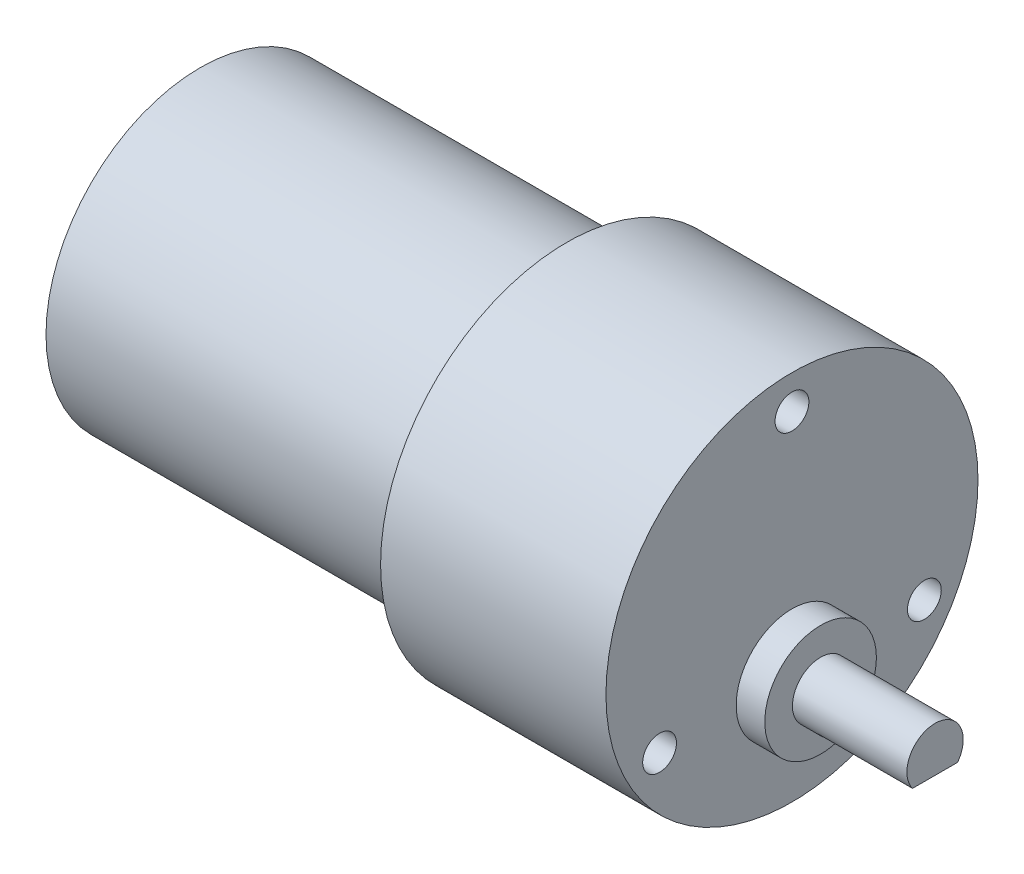
ISO-10303-21;
HEADER;
FILE_DESCRIPTION(('STEP AP214'),'2;1');
FILE_NAME('part.step','',(''),(''),'','','');
FILE_SCHEMA(('AUTOMOTIVE_DESIGN { 1 0 10303 214 1 1 1 1 }'));
ENDSEC;
DATA;
#1=APPLICATION_CONTEXT('core data for automotive mechanical design processes');
#2=APPLICATION_PROTOCOL_DEFINITION('international standard','automotive_design',2000,#1);
#3=PRODUCT_CONTEXT('',#1,'mechanical');
#4=PRODUCT('Part','Part','',(#3));
#5=PRODUCT_RELATED_PRODUCT_CATEGORY('part','',(#4));
#6=PRODUCT_DEFINITION_FORMATION('','',#4);
#7=PRODUCT_DEFINITION_CONTEXT('part definition',#1,'design');
#8=PRODUCT_DEFINITION('design','',#6,#7);
#9=PRODUCT_DEFINITION_SHAPE('','',#8);
#10=(LENGTH_UNIT() NAMED_UNIT(*) SI_UNIT(.MILLI.,.METRE.));
#11=(NAMED_UNIT(*) PLANE_ANGLE_UNIT() SI_UNIT($,.RADIAN.));
#12=(NAMED_UNIT(*) SI_UNIT($,.STERADIAN.) SOLID_ANGLE_UNIT());
#13=UNCERTAINTY_MEASURE_WITH_UNIT(LENGTH_MEASURE(1.E-05),#10,'distance_accuracy_value','');
#14=(GEOMETRIC_REPRESENTATION_CONTEXT(3) GLOBAL_UNCERTAINTY_ASSIGNED_CONTEXT((#13)) GLOBAL_UNIT_ASSIGNED_CONTEXT((#10,
#11,#12)) REPRESENTATION_CONTEXT('',''));
#15=CARTESIAN_POINT('',(0.,0.,0.));
#16=DIRECTION('',(0.,0.,1.));
#17=DIRECTION('',(1.,0.,0.));
#18=AXIS2_PLACEMENT_3D('',#15,#16,#17);
#19=CARTESIAN_POINT('',(32.7,-6.60400000000002,0.));
#20=DIRECTION('',(-1.,0.,0.));
#21=DIRECTION('',(0.,0.,1.));
#22=AXIS2_PLACEMENT_3D('',#19,#20,#21);
#23=CYLINDRICAL_SURFACE('',#22,2.5);
#24=CARTESIAN_POINT('',(22.54,-6.60400000000002,0.));
#25=DIRECTION('',(1.,0.,0.));
#26=DIRECTION('',(0.,0.,-1.));
#27=AXIS2_PLACEMENT_3D('',#24,#25,#26);
#28=CIRCLE('',#27,2.5);
#29=CARTESIAN_POINT('',(22.54,-6.60400000000002,-2.5));
#30=VERTEX_POINT('',#29);
#31=EDGE_CURVE('E74',#30,#30,#28,.T.);
#32=ORIENTED_EDGE('',*,*,#31,.T.);
#33=EDGE_LOOP('',(#32));
#34=FACE_BOUND('',#33,.T.);
#35=DIRECTION('',(1.,0.,0.));
#36=VECTOR('',#35,1.);
#37=CARTESIAN_POINT('',(24.318,-8.10400000000002,2.));
#38=LINE('',#37,#36);
#39=CARTESIAN_POINT('',(24.318,-8.10400000000002,2.));
#40=VERTEX_POINT('',#39);
#41=CARTESIAN_POINT('',(32.7,-8.10400000000002,2.));
#42=VERTEX_POINT('',#41);
#43=EDGE_CURVE('E62',#40,#42,#38,.T.);
#44=ORIENTED_EDGE('',*,*,#43,.T.);
#45=CARTESIAN_POINT('',(32.7,-6.60400000000002,0.));
#46=DIRECTION('',(1.,0.,0.));
#47=DIRECTION('',(0.,0.,-1.));
#48=AXIS2_PLACEMENT_3D('',#45,#46,#47);
#49=CIRCLE('',#48,2.5);
#50=CARTESIAN_POINT('',(32.7,-8.10400000000002,-2.));
#51=VERTEX_POINT('',#50);
#52=EDGE_CURVE('E69',#51,#42,#49,.T.);
#53=ORIENTED_EDGE('',*,*,#52,.F.);
#54=DIRECTION('',(1.,0.,0.));
#55=VECTOR('',#54,1.);
#56=CARTESIAN_POINT('',(24.318,-8.10400000000002,-2.));
#57=LINE('',#56,#55);
#58=CARTESIAN_POINT('',(24.318,-8.10400000000002,-2.));
#59=VERTEX_POINT('',#58);
#60=EDGE_CURVE('E49',#59,#51,#57,.T.);
#61=ORIENTED_EDGE('',*,*,#60,.F.);
#62=CARTESIAN_POINT('',(24.318,-6.60400000000002,0.));
#63=DIRECTION('',(1.,0.,0.));
#64=DIRECTION('',(0.,0.,-1.));
#65=AXIS2_PLACEMENT_3D('',#62,#63,#64);
#66=CIRCLE('',#65,2.5);
#67=EDGE_CURVE('E70',#40,#59,#66,.T.);
#68=ORIENTED_EDGE('',*,*,#67,.F.);
#69=EDGE_LOOP('',(#44,#53,#61,#68));
#70=FACE_BOUND('',#69,.T.);
#71=ADVANCED_FACE('F34',(#34,#70),#23,.T.);
#72=CARTESIAN_POINT('',(32.7,-6.60400000000002,0.));
#73=DIRECTION('',(1.,0.,0.));
#74=DIRECTION('',(0.,0.,-1.));
#75=AXIS2_PLACEMENT_3D('',#72,#73,#74);
#76=PLANE('',#75);
#77=ORIENTED_EDGE('',*,*,#52,.T.);
#78=DIRECTION('',(0.,0.,-1.));
#79=VECTOR('',#78,1.);
#80=CARTESIAN_POINT('',(32.7,-8.10400000000002,-5.64142135623731));
#81=LINE('',#80,#79);
#82=EDGE_CURVE('E59',#42,#51,#81,.T.);
#83=ORIENTED_EDGE('',*,*,#82,.T.);
#84=EDGE_LOOP('',(#77,#83));
#85=FACE_BOUND('',#84,.T.);
#86=ADVANCED_FACE('F72',(#85),#76,.T.);
#87=CARTESIAN_POINT('',(-34.512,0.,0.));
#88=DIRECTION('',(-1.,0.,0.));
#89=DIRECTION('',(0.,0.,1.));
#90=AXIS2_PLACEMENT_3D('',#87,#88,#89);
#91=PLANE('',#90);
#92=CARTESIAN_POINT('',(-34.512,0.,0.));
#93=DIRECTION('',(-1.,0.,0.));
#94=DIRECTION('',(0.,0.,1.));
#95=AXIS2_PLACEMENT_3D('',#92,#93,#94);
#96=CIRCLE('',#95,5.);
#97=CARTESIAN_POINT('',(-34.512,0.,5.));
#98=VERTEX_POINT('',#97);
#99=EDGE_CURVE('E80',#98,#98,#96,.T.);
#100=ORIENTED_EDGE('',*,*,#99,.T.);
#101=EDGE_LOOP('',(#100));
#102=FACE_BOUND('',#101,.T.);
#103=CARTESIAN_POINT('',(-34.512,0.,0.));
#104=DIRECTION('',(-1.,0.,0.));
#105=DIRECTION('',(0.,0.,1.));
#106=AXIS2_PLACEMENT_3D('',#103,#104,#105);
#107=CIRCLE('',#106,1.143);
#108=CARTESIAN_POINT('',(-34.512,0.,1.143));
#109=VERTEX_POINT('',#108);
#110=EDGE_CURVE('E191',#109,#109,#107,.T.);
#111=ORIENTED_EDGE('',*,*,#110,.F.);
#112=EDGE_LOOP('',(#111));
#113=FACE_BOUND('',#112,.T.);
#114=ADVANCED_FACE('F144',(#102,#113),#91,.T.);
#115=CARTESIAN_POINT('',(-32.512,0.,0.));
#116=DIRECTION('',(-1.,0.,0.));
#117=DIRECTION('',(0.,0.,1.));
#118=AXIS2_PLACEMENT_3D('',#115,#116,#117);
#119=PLANE('',#118);
#120=CARTESIAN_POINT('',(-32.512,0.,0.));
#121=DIRECTION('',(-1.,0.,0.));
#122=DIRECTION('',(0.,0.,1.));
#123=AXIS2_PLACEMENT_3D('',#120,#121,#122);
#124=CIRCLE('',#123,13.6906);
#125=CARTESIAN_POINT('',(-32.512,0.,13.6906));
#126=VERTEX_POINT('',#125);
#127=EDGE_CURVE('E104',#126,#126,#124,.T.);
#128=ORIENTED_EDGE('',*,*,#127,.T.);
#129=EDGE_LOOP('',(#128));
#130=FACE_BOUND('',#129,.T.);
#131=CARTESIAN_POINT('',(-32.512,0.,0.));
#132=DIRECTION('',(-1.,0.,0.));
#133=DIRECTION('',(0.,0.,1.));
#134=AXIS2_PLACEMENT_3D('',#131,#132,#133);
#135=CIRCLE('',#134,5.);
#136=CARTESIAN_POINT('',(-32.512,0.,5.));
#137=VERTEX_POINT('',#136);
#138=EDGE_CURVE('E83',#137,#137,#135,.T.);
#139=ORIENTED_EDGE('',*,*,#138,.F.);
#140=EDGE_LOOP('',(#139));
#141=FACE_BOUND('',#140,.T.);
#142=ADVANCED_FACE('F151',(#130,#141),#119,.T.);
#143=CARTESIAN_POINT('',(22.54,-6.60400000000002,0.));
#144=DIRECTION('',(1.,0.,0.));
#145=DIRECTION('',(0.,0.,-1.));
#146=AXIS2_PLACEMENT_3D('',#143,#144,#145);
#147=PLANE('',#146);
#148=CARTESIAN_POINT('',(22.54,-6.60400000000002,0.));
#149=DIRECTION('',(1.,0.,0.));
#150=DIRECTION('',(0.,0.,-1.));
#151=AXIS2_PLACEMENT_3D('',#148,#149,#150);
#152=CIRCLE('',#151,4.953);
#153=CARTESIAN_POINT('',(22.54,-6.60400000000002,-4.953));
#154=VERTEX_POINT('',#153);
#155=EDGE_CURVE('E77',#154,#154,#152,.T.);
#156=ORIENTED_EDGE('',*,*,#155,.T.);
#157=EDGE_LOOP('',(#156));
#158=FACE_BOUND('',#157,.T.);
#159=ORIENTED_EDGE('',*,*,#31,.F.);
#160=EDGE_LOOP('',(#159));
#161=FACE_BOUND('',#160,.T.);
#162=ADVANCED_FACE('F148',(#158,#161),#147,.T.);
#163=CARTESIAN_POINT('',(20.,0.,0.));
#164=DIRECTION('',(1.,0.,0.));
#165=DIRECTION('',(0.,0.,-1.));
#166=AXIS2_PLACEMENT_3D('',#163,#164,#165);
#167=PLANE('',#166);
#168=CARTESIAN_POINT('',(20.,0.,0.));
#169=DIRECTION('',(1.,0.,0.));
#170=DIRECTION('',(0.,0.,-1.));
#171=AXIS2_PLACEMENT_3D('',#168,#169,#170);
#172=CIRCLE('',#171,16.51);
#173=CARTESIAN_POINT('',(20.,0.,-16.51));
#174=VERTEX_POINT('',#173);
#175=EDGE_CURVE('E42',#174,#174,#172,.T.);
#176=ORIENTED_EDGE('',*,*,#175,.T.);
#177=EDGE_LOOP('',(#176));
#178=FACE_BOUND('',#177,.T.);
#179=CARTESIAN_POINT('',(20.,13.51,0.));
#180=DIRECTION('',(1.,0.,0.));
#181=DIRECTION('',(0.,0.,-1.));
#182=AXIS2_PLACEMENT_3D('',#179,#180,#181);
#183=CIRCLE('',#182,1.5);
#184=CARTESIAN_POINT('',(20.,13.51,-1.5));
#185=VERTEX_POINT('',#184);
#186=EDGE_CURVE('E98',#185,#185,#183,.T.);
#187=ORIENTED_EDGE('',*,*,#186,.F.);
#188=EDGE_LOOP('',(#187));
#189=FACE_BOUND('',#188,.T.);
#190=CARTESIAN_POINT('',(20.,-6.84159698893429,-11.75));
#191=DIRECTION('',(1.,0.,0.));
#192=DIRECTION('',(0.,0.,-1.));
#193=AXIS2_PLACEMENT_3D('',#190,#191,#192);
#194=CIRCLE('',#193,1.5);
#195=CARTESIAN_POINT('',(20.,-6.84159698893429,-13.25));
#196=VERTEX_POINT('',#195);
#197=EDGE_CURVE('E92',#196,#196,#194,.T.);
#198=ORIENTED_EDGE('',*,*,#197,.F.);
#199=EDGE_LOOP('',(#198));
#200=FACE_BOUND('',#199,.T.);
#201=CARTESIAN_POINT('',(20.,-6.84159698893428,11.75));
#202=DIRECTION('',(1.,0.,0.));
#203=DIRECTION('',(0.,0.,-1.));
#204=AXIS2_PLACEMENT_3D('',#201,#202,#203);
#205=CIRCLE('',#204,1.5);
#206=CARTESIAN_POINT('',(20.,-6.84159698893428,10.25));
#207=VERTEX_POINT('',#206);
#208=EDGE_CURVE('E87',#207,#207,#205,.T.);
#209=ORIENTED_EDGE('',*,*,#208,.F.);
#210=EDGE_LOOP('',(#209));
#211=FACE_BOUND('',#210,.T.);
#212=CARTESIAN_POINT('',(20.,-6.60400000000002,0.));
#213=DIRECTION('',(1.,0.,0.));
#214=DIRECTION('',(0.,0.,-1.));
#215=AXIS2_PLACEMENT_3D('',#212,#213,#214);
#216=CIRCLE('',#215,4.953);
#217=CARTESIAN_POINT('',(20.,-6.60400000000002,-4.953));
#218=VERTEX_POINT('',#217);
#219=EDGE_CURVE('E73',#218,#218,#216,.T.);
#220=ORIENTED_EDGE('',*,*,#219,.F.);
#221=EDGE_LOOP('',(#220));
#222=FACE_BOUND('',#221,.T.);
#223=ADVANCED_FACE('F118',(#178,#189,#200,#211,#222),#167,.T.);
#224=CARTESIAN_POINT('',(0.,0.,0.));
#225=DIRECTION('',(1.,0.,0.));
#226=DIRECTION('',(0.,0.,-1.));
#227=AXIS2_PLACEMENT_3D('',#224,#225,#226);
#228=PLANE('',#227);
#229=CARTESIAN_POINT('',(0.,0.,0.));
#230=DIRECTION('',(1.,0.,0.));
#231=DIRECTION('',(0.,0.,-1.));
#232=AXIS2_PLACEMENT_3D('',#229,#230,#231);
#233=CIRCLE('',#232,16.51);
#234=CARTESIAN_POINT('',(0.,0.,-16.51));
#235=VERTEX_POINT('',#234);
#236=EDGE_CURVE('E109',#235,#235,#233,.T.);
#237=ORIENTED_EDGE('',*,*,#236,.F.);
#238=EDGE_LOOP('',(#237));
#239=FACE_BOUND('',#238,.T.);
#240=CARTESIAN_POINT('',(0.,0.,0.));
#241=DIRECTION('',(1.,0.,0.));
#242=DIRECTION('',(0.,0.,-1.));
#243=AXIS2_PLACEMENT_3D('',#240,#241,#242);
#244=CIRCLE('',#243,13.6906);
#245=CARTESIAN_POINT('',(0.,0.,-13.6906));
#246=VERTEX_POINT('',#245);
#247=EDGE_CURVE('E11',#246,#246,#244,.F.);
#248=ORIENTED_EDGE('',*,*,#247,.F.);
#249=EDGE_LOOP('',(#248));
#250=FACE_BOUND('',#249,.T.);
#251=ADVANCED_FACE('F115',(#239,#250),#228,.F.);
#252=CARTESIAN_POINT('',(20.,0.,0.));
#253=DIRECTION('',(-1.,0.,0.));
#254=DIRECTION('',(0.,0.,1.));
#255=AXIS2_PLACEMENT_3D('',#252,#253,#254);
#256=CYLINDRICAL_SURFACE('',#255,16.51);
#257=ORIENTED_EDGE('',*,*,#175,.F.);
#258=EDGE_LOOP('',(#257));
#259=FACE_BOUND('',#258,.T.);
#260=ORIENTED_EDGE('',*,*,#236,.T.);
#261=EDGE_LOOP('',(#260));
#262=FACE_BOUND('',#261,.T.);
#263=ADVANCED_FACE('F36',(#259,#262),#256,.T.);
#264=CARTESIAN_POINT('',(-32.512,0.,0.));
#265=DIRECTION('',(1.,0.,0.));
#266=DIRECTION('',(0.,0.,-1.));
#267=AXIS2_PLACEMENT_3D('',#264,#265,#266);
#268=CYLINDRICAL_SURFACE('',#267,13.6906);
#269=ORIENTED_EDGE('',*,*,#127,.F.);
#270=EDGE_LOOP('',(#269));
#271=FACE_BOUND('',#270,.T.);
#272=ORIENTED_EDGE('',*,*,#247,.T.);
#273=EDGE_LOOP('',(#272));
#274=FACE_BOUND('',#273,.T.);
#275=ADVANCED_FACE('F121',(#271,#274),#268,.T.);
#276=CARTESIAN_POINT('',(13.65,13.51,0.));
#277=DIRECTION('',(1.,0.,0.));
#278=DIRECTION('',(0.,0.,-1.));
#279=AXIS2_PLACEMENT_3D('',#276,#277,#278);
#280=CYLINDRICAL_SURFACE('',#279,1.5);
#281=CARTESIAN_POINT('',(13.65,13.51,0.));
#282=DIRECTION('',(1.,0.,0.));
#283=DIRECTION('',(0.,0.,-1.));
#284=AXIS2_PLACEMENT_3D('',#281,#282,#283);
#285=CIRCLE('',#284,1.5);
#286=CARTESIAN_POINT('',(13.65,13.51,-1.5));
#287=VERTEX_POINT('',#286);
#288=EDGE_CURVE('E101',#287,#287,#285,.T.);
#289=ORIENTED_EDGE('',*,*,#288,.F.);
#290=EDGE_LOOP('',(#289));
#291=FACE_BOUND('',#290,.T.);
#292=ORIENTED_EDGE('',*,*,#186,.T.);
#293=EDGE_LOOP('',(#292));
#294=FACE_BOUND('',#293,.T.);
#295=ADVANCED_FACE('F123',(#291,#294),#280,.F.);
#296=CARTESIAN_POINT('',(13.65,13.51,0.));
#297=DIRECTION('',(1.,0.,0.));
#298=DIRECTION('',(0.,0.,-1.));
#299=AXIS2_PLACEMENT_3D('',#296,#297,#298);
#300=PLANE('',#299);
#301=ORIENTED_EDGE('',*,*,#288,.T.);
#302=EDGE_LOOP('',(#301));
#303=FACE_BOUND('',#302,.T.);
#304=ADVANCED_FACE('F130',(#303),#300,.T.);
#305=CARTESIAN_POINT('',(13.65,-6.84159698893429,-11.75));
#306=DIRECTION('',(1.,0.,0.));
#307=DIRECTION('',(0.,0.,-1.));
#308=AXIS2_PLACEMENT_3D('',#305,#306,#307);
#309=CYLINDRICAL_SURFACE('',#308,1.5);
#310=CARTESIAN_POINT('',(13.65,-6.84159698893429,-11.75));
#311=DIRECTION('',(1.,0.,0.));
#312=DIRECTION('',(0.,0.,-1.));
#313=AXIS2_PLACEMENT_3D('',#310,#311,#312);
#314=CIRCLE('',#313,1.5);
#315=CARTESIAN_POINT('',(13.65,-6.84159698893429,-13.25));
#316=VERTEX_POINT('',#315);
#317=EDGE_CURVE('E95',#316,#316,#314,.T.);
#318=ORIENTED_EDGE('',*,*,#317,.F.);
#319=EDGE_LOOP('',(#318));
#320=FACE_BOUND('',#319,.T.);
#321=ORIENTED_EDGE('',*,*,#197,.T.);
#322=EDGE_LOOP('',(#321));
#323=FACE_BOUND('',#322,.T.);
#324=ADVANCED_FACE('F169',(#320,#323),#309,.F.);
#325=CARTESIAN_POINT('',(13.65,-6.84159698893429,-11.75));
#326=DIRECTION('',(1.,0.,0.));
#327=DIRECTION('',(0.,0.,-1.));
#328=AXIS2_PLACEMENT_3D('',#325,#326,#327);
#329=PLANE('',#328);
#330=ORIENTED_EDGE('',*,*,#317,.T.);
#331=EDGE_LOOP('',(#330));
#332=FACE_BOUND('',#331,.T.);
#333=ADVANCED_FACE('F165',(#332),#329,.T.);
#334=CARTESIAN_POINT('',(13.65,-6.84159698893428,11.75));
#335=DIRECTION('',(1.,0.,0.));
#336=DIRECTION('',(0.,0.,-1.));
#337=AXIS2_PLACEMENT_3D('',#334,#335,#336);
#338=CYLINDRICAL_SURFACE('',#337,1.5);
#339=CARTESIAN_POINT('',(13.65,-6.84159698893428,11.75));
#340=DIRECTION('',(1.,0.,0.));
#341=DIRECTION('',(0.,0.,-1.));
#342=AXIS2_PLACEMENT_3D('',#339,#340,#341);
#343=CIRCLE('',#342,1.5);
#344=CARTESIAN_POINT('',(13.65,-6.84159698893428,10.25));
#345=VERTEX_POINT('',#344);
#346=EDGE_CURVE('E89',#345,#345,#343,.T.);
#347=ORIENTED_EDGE('',*,*,#346,.F.);
#348=EDGE_LOOP('',(#347));
#349=FACE_BOUND('',#348,.T.);
#350=ORIENTED_EDGE('',*,*,#208,.T.);
#351=EDGE_LOOP('',(#350));
#352=FACE_BOUND('',#351,.T.);
#353=ADVANCED_FACE('F161',(#349,#352),#338,.F.);
#354=CARTESIAN_POINT('',(13.65,-6.84159698893428,11.75));
#355=DIRECTION('',(1.,0.,0.));
#356=DIRECTION('',(0.,0.,-1.));
#357=AXIS2_PLACEMENT_3D('',#354,#355,#356);
#358=PLANE('',#357);
#359=ORIENTED_EDGE('',*,*,#346,.T.);
#360=EDGE_LOOP('',(#359));
#361=FACE_BOUND('',#360,.T.);
#362=ADVANCED_FACE('F157',(#361),#358,.T.);
#363=CARTESIAN_POINT('',(22.54,-6.60400000000002,0.));
#364=DIRECTION('',(-1.,0.,0.));
#365=DIRECTION('',(0.,0.,1.));
#366=AXIS2_PLACEMENT_3D('',#363,#364,#365);
#367=CYLINDRICAL_SURFACE('',#366,4.953);
#368=ORIENTED_EDGE('',*,*,#155,.F.);
#369=EDGE_LOOP('',(#368));
#370=FACE_BOUND('',#369,.T.);
#371=ORIENTED_EDGE('',*,*,#219,.T.);
#372=EDGE_LOOP('',(#371));
#373=FACE_BOUND('',#372,.T.);
#374=ADVANCED_FACE('F153',(#370,#373),#367,.T.);
#375=CARTESIAN_POINT('',(-34.512,0.,0.));
#376=DIRECTION('',(1.,0.,0.));
#377=DIRECTION('',(0.,0.,-1.));
#378=AXIS2_PLACEMENT_3D('',#375,#376,#377);
#379=CYLINDRICAL_SURFACE('',#378,5.);
#380=ORIENTED_EDGE('',*,*,#99,.F.);
#381=EDGE_LOOP('',(#380));
#382=FACE_BOUND('',#381,.T.);
#383=ORIENTED_EDGE('',*,*,#138,.T.);
#384=EDGE_LOOP('',(#383));
#385=FACE_BOUND('',#384,.T.);
#386=ADVANCED_FACE('F156',(#382,#385),#379,.T.);
#387=CARTESIAN_POINT('',(-37.56,0.,0.));
#388=DIRECTION('',(1.,0.,0.));
#389=DIRECTION('',(0.,0.,-1.));
#390=AXIS2_PLACEMENT_3D('',#387,#388,#389);
#391=CYLINDRICAL_SURFACE('',#390,1.143);
#392=CARTESIAN_POINT('',(-37.56,0.,0.));
#393=DIRECTION('',(-1.,0.,0.));
#394=DIRECTION('',(0.,0.,1.));
#395=AXIS2_PLACEMENT_3D('',#392,#393,#394);
#396=CIRCLE('',#395,1.143);
#397=CARTESIAN_POINT('',(-37.56,0.,1.143));
#398=VERTEX_POINT('',#397);
#399=EDGE_CURVE('E188',#398,#398,#396,.T.);
#400=ORIENTED_EDGE('',*,*,#399,.F.);
#401=EDGE_LOOP('',(#400));
#402=FACE_BOUND('',#401,.T.);
#403=ORIENTED_EDGE('',*,*,#110,.T.);
#404=EDGE_LOOP('',(#403));
#405=FACE_BOUND('',#404,.T.);
#406=ADVANCED_FACE('F212',(#402,#405),#391,.T.);
#407=CARTESIAN_POINT('',(-37.56,0.,0.));
#408=DIRECTION('',(-1.,0.,0.));
#409=DIRECTION('',(0.,0.,1.));
#410=AXIS2_PLACEMENT_3D('',#407,#408,#409);
#411=PLANE('',#410);
#412=ORIENTED_EDGE('',*,*,#399,.T.);
#413=EDGE_LOOP('',(#412));
#414=FACE_BOUND('',#413,.T.);
#415=ADVANCED_FACE('F207',(#414),#411,.T.);
#416=CARTESIAN_POINT('',(24.318,-8.10400000000002,-5.64142135623731));
#417=DIRECTION('',(0.,-1.,0.));
#418=DIRECTION('',(0.,0.,-1.));
#419=AXIS2_PLACEMENT_3D('',#416,#417,#418);
#420=PLANE('',#419);
#421=ORIENTED_EDGE('',*,*,#82,.F.);
#422=ORIENTED_EDGE('',*,*,#43,.F.);
#423=DIRECTION('',(0.,0.,-1.));
#424=VECTOR('',#423,1.);
#425=CARTESIAN_POINT('',(24.318,-8.10400000000002,-5.64142135623731));
#426=LINE('',#425,#424);
#427=EDGE_CURVE('E55',#40,#59,#426,.T.);
#428=ORIENTED_EDGE('',*,*,#427,.T.);
#429=ORIENTED_EDGE('',*,*,#60,.T.);
#430=EDGE_LOOP('',(#421,#422,#428,#429));
#431=FACE_BOUND('',#430,.T.);
#432=ADVANCED_FACE('F61',(#431),#420,.T.);
#433=CARTESIAN_POINT('',(24.318,-6.60400000000002,-5.64142135623731));
#434=DIRECTION('',(1.,0.,0.));
#435=DIRECTION('',(0.,0.,-1.));
#436=AXIS2_PLACEMENT_3D('',#433,#434,#435);
#437=PLANE('',#436);
#438=ORIENTED_EDGE('',*,*,#427,.F.);
#439=ORIENTED_EDGE('',*,*,#67,.T.);
#440=EDGE_LOOP('',(#438,#439));
#441=FACE_BOUND('',#440,.T.);
#442=ADVANCED_FACE('F201',(#441),#437,.T.);
#443=CLOSED_SHELL('',(#71,#86,#114,#142,#162,#223,#251,#263,#275,#295,#304,#324,#333,#353,#362,
#374,#386,#406,#415,#432,#442));
#444=MANIFOLD_SOLID_BREP('B2',#443);
#445=ADVANCED_BREP_SHAPE_REPRESENTATION('',(#18,#444),#14);
#446=SHAPE_DEFINITION_REPRESENTATION(#9,#445);
ENDSEC;
END-ISO-10303-21;
